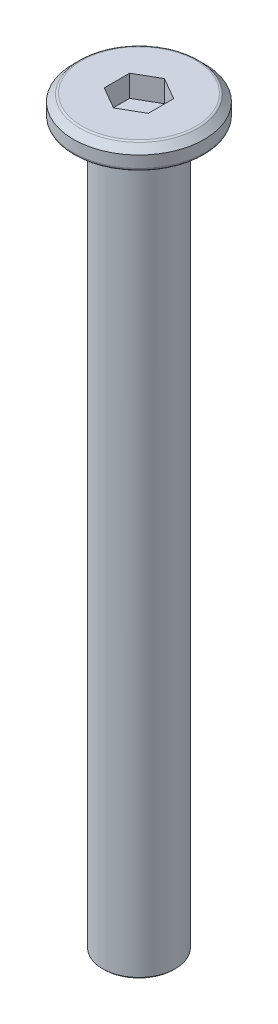
ISO-10303-21;
HEADER;
FILE_DESCRIPTION(('STEP AP214'),'2;1');
FILE_NAME('part.step','',(''),(''),'','','');
FILE_SCHEMA(('AUTOMOTIVE_DESIGN { 1 0 10303 214 1 1 1 1 }'));
ENDSEC;
DATA;
#1=APPLICATION_CONTEXT('core data for automotive mechanical design processes');
#2=APPLICATION_PROTOCOL_DEFINITION('international standard','automotive_design',2000,#1);
#3=PRODUCT_CONTEXT('',#1,'mechanical');
#4=PRODUCT('Part','Part','',(#3));
#5=PRODUCT_RELATED_PRODUCT_CATEGORY('part','',(#4));
#6=PRODUCT_DEFINITION_FORMATION('','',#4);
#7=PRODUCT_DEFINITION_CONTEXT('part definition',#1,'design');
#8=PRODUCT_DEFINITION('design','',#6,#7);
#9=PRODUCT_DEFINITION_SHAPE('','',#8);
#10=(LENGTH_UNIT() NAMED_UNIT(*) SI_UNIT(.MILLI.,.METRE.));
#11=(NAMED_UNIT(*) PLANE_ANGLE_UNIT() SI_UNIT($,.RADIAN.));
#12=(NAMED_UNIT(*) SI_UNIT($,.STERADIAN.) SOLID_ANGLE_UNIT());
#13=UNCERTAINTY_MEASURE_WITH_UNIT(LENGTH_MEASURE(1.E-05),#10,'distance_accuracy_value','');
#14=(GEOMETRIC_REPRESENTATION_CONTEXT(3) GLOBAL_UNCERTAINTY_ASSIGNED_CONTEXT((#13)) GLOBAL_UNIT_ASSIGNED_CONTEXT((#10,
#11,#12)) REPRESENTATION_CONTEXT('',''));
#15=CARTESIAN_POINT('',(0.,0.,0.));
#16=DIRECTION('',(0.,0.,1.));
#17=DIRECTION('',(1.,0.,0.));
#18=AXIS2_PLACEMENT_3D('',#15,#16,#17);
#19=CARTESIAN_POINT('',(0.,1.5,0.));
#20=DIRECTION('',(0.,-1.,0.));
#21=DIRECTION('',(0.,0.,-1.));
#22=AXIS2_PLACEMENT_3D('',#19,#20,#21);
#23=CYLINDRICAL_SURFACE('',#22,4.5);
#24=CARTESIAN_POINT('',(0.,0.2,0.));
#25=DIRECTION('',(0.,1.,0.));
#26=DIRECTION('',(0.,0.,1.));
#27=AXIS2_PLACEMENT_3D('',#24,#25,#26);
#28=CIRCLE('',#27,4.5);
#29=CARTESIAN_POINT('',(0.,0.2,4.5));
#30=VERTEX_POINT('',#29);
#31=EDGE_CURVE('E131',#30,#30,#28,.T.);
#32=ORIENTED_EDGE('',*,*,#31,.T.);
#33=EDGE_LOOP('',(#32));
#34=FACE_BOUND('',#33,.T.);
#35=CARTESIAN_POINT('',(0.,0.999999999999997,0.));
#36=DIRECTION('',(0.,1.,0.));
#37=DIRECTION('',(0.,0.,1.));
#38=AXIS2_PLACEMENT_3D('',#35,#36,#37);
#39=CIRCLE('',#38,4.5);
#40=CARTESIAN_POINT('',(0.,0.999999999999997,4.5));
#41=VERTEX_POINT('',#40);
#42=EDGE_CURVE('E117',#41,#41,#39,.F.);
#43=ORIENTED_EDGE('',*,*,#42,.T.);
#44=EDGE_LOOP('',(#43));
#45=FACE_BOUND('',#44,.T.);
#46=ADVANCED_FACE('F16',(#34,#45),#23,.T.);
#47=CARTESIAN_POINT('',(0.,1.5,0.));
#48=DIRECTION('',(0.,1.,0.));
#49=DIRECTION('',(0.,0.,1.));
#50=AXIS2_PLACEMENT_3D('',#47,#48,#49);
#51=PLANE('',#50);
#52=CARTESIAN_POINT('',(0.,1.5,0.));
#53=DIRECTION('',(0.,1.,0.));
#54=DIRECTION('',(0.,0.,1.));
#55=AXIS2_PLACEMENT_3D('',#52,#53,#54);
#56=CIRCLE('',#55,3.91715728752538);
#57=CARTESIAN_POINT('',(0.,1.5,3.91715728752538));
#58=VERTEX_POINT('',#57);
#59=EDGE_CURVE('E125',#58,#58,#56,.T.);
#60=ORIENTED_EDGE('',*,*,#59,.T.);
#61=EDGE_LOOP('',(#60));
#62=FACE_BOUND('',#61,.T.);
#63=DIRECTION('',(-0.866025403784439,0.,-0.5));
#64=VECTOR('',#63,1.);
#65=CARTESIAN_POINT('',(1.51554445662277,1.5,-0.875));
#66=LINE('',#65,#64);
#67=CARTESIAN_POINT('',(1.51554445662277,1.5,-0.875));
#68=VERTEX_POINT('',#67);
#69=CARTESIAN_POINT('',(0.,1.5,-1.75));
#70=VERTEX_POINT('',#69);
#71=EDGE_CURVE('E32',#68,#70,#66,.T.);
#72=ORIENTED_EDGE('',*,*,#71,.F.);
#73=DIRECTION('',(0.,0.,-1.));
#74=VECTOR('',#73,1.);
#75=CARTESIAN_POINT('',(1.51554445662277,1.5,0.875000000000001));
#76=LINE('',#75,#74);
#77=CARTESIAN_POINT('',(1.51554445662277,1.5,0.875000000000001));
#78=VERTEX_POINT('',#77);
#79=EDGE_CURVE('E113',#78,#68,#76,.T.);
#80=ORIENTED_EDGE('',*,*,#79,.F.);
#81=DIRECTION('',(0.866025403784439,0.,-0.5));
#82=VECTOR('',#81,1.);
#83=CARTESIAN_POINT('',(0.,1.5,1.75));
#84=LINE('',#83,#82);
#85=CARTESIAN_POINT('',(0.,1.5,1.75));
#86=VERTEX_POINT('',#85);
#87=EDGE_CURVE('E111',#86,#78,#84,.T.);
#88=ORIENTED_EDGE('',*,*,#87,.F.);
#89=DIRECTION('',(0.866025403784439,0.,0.5));
#90=VECTOR('',#89,1.);
#91=CARTESIAN_POINT('',(-1.51554445662277,1.5,0.875000000000001));
#92=LINE('',#91,#90);
#93=CARTESIAN_POINT('',(-1.51554445662277,1.5,0.875000000000001));
#94=VERTEX_POINT('',#93);
#95=EDGE_CURVE('E79',#94,#86,#92,.T.);
#96=ORIENTED_EDGE('',*,*,#95,.F.);
#97=DIRECTION('',(0.,0.,1.));
#98=VECTOR('',#97,1.);
#99=CARTESIAN_POINT('',(-1.51554445662277,1.5,-0.875));
#100=LINE('',#99,#98);
#101=CARTESIAN_POINT('',(-1.51554445662277,1.5,-0.875));
#102=VERTEX_POINT('',#101);
#103=EDGE_CURVE('E107',#102,#94,#100,.T.);
#104=ORIENTED_EDGE('',*,*,#103,.F.);
#105=DIRECTION('',(-0.866025403784439,0.,0.5));
#106=VECTOR('',#105,1.);
#107=CARTESIAN_POINT('',(0.,1.5,-1.75));
#108=LINE('',#107,#106);
#109=EDGE_CURVE('E104',#70,#102,#108,.T.);
#110=ORIENTED_EDGE('',*,*,#109,.F.);
#111=EDGE_LOOP('',(#72,#80,#88,#96,#104,#110));
#112=FACE_BOUND('',#111,.T.);
#113=ADVANCED_FACE('F158',(#62,#112),#51,.T.);
#114=CARTESIAN_POINT('',(0.,0.,0.));
#115=DIRECTION('',(0.,1.,0.));
#116=DIRECTION('',(0.,0.,1.));
#117=AXIS2_PLACEMENT_3D('',#114,#115,#116);
#118=PLANE('',#117);
#119=CARTESIAN_POINT('',(0.,0.,0.));
#120=DIRECTION('',(0.,1.,0.));
#121=DIRECTION('',(0.,0.,1.));
#122=AXIS2_PLACEMENT_3D('',#119,#120,#121);
#123=CIRCLE('',#122,2.75);
#124=CARTESIAN_POINT('',(0.,0.,2.75));
#125=VERTEX_POINT('',#124);
#126=EDGE_CURVE('E140',#125,#125,#123,.T.);
#127=ORIENTED_EDGE('',*,*,#126,.T.);
#128=EDGE_LOOP('',(#127));
#129=FACE_BOUND('',#128,.T.);
#130=CARTESIAN_POINT('',(0.,0.,0.));
#131=DIRECTION('',(0.,1.,0.));
#132=DIRECTION('',(0.,0.,1.));
#133=AXIS2_PLACEMENT_3D('',#130,#131,#132);
#134=CIRCLE('',#133,4.3);
#135=CARTESIAN_POINT('',(0.,0.,4.3));
#136=VERTEX_POINT('',#135);
#137=EDGE_CURVE('E134',#136,#136,#134,.F.);
#138=ORIENTED_EDGE('',*,*,#137,.T.);
#139=EDGE_LOOP('',(#138));
#140=FACE_BOUND('',#139,.T.);
#141=ADVANCED_FACE('F164',(#129,#140),#118,.F.);
#142=CARTESIAN_POINT('',(0.,1.5,0.));
#143=DIRECTION('',(0.,-1.,0.));
#144=DIRECTION('',(0.,0.,-1.));
#145=AXIS2_PLACEMENT_3D('',#142,#143,#144);
#146=CONICAL_SURFACE('',#145,4.,0.785398163397447);
#147=CARTESIAN_POINT('',(0.,1.44142135623731,0.));
#148=DIRECTION('',(0.,1.,0.));
#149=DIRECTION('',(0.,0.,1.));
#150=AXIS2_PLACEMENT_3D('',#147,#148,#149);
#151=CIRCLE('',#150,4.05857864376269);
#152=CARTESIAN_POINT('',(0.,1.44142135623731,4.05857864376269));
#153=VERTEX_POINT('',#152);
#154=EDGE_CURVE('E128',#153,#153,#151,.F.);
#155=ORIENTED_EDGE('',*,*,#154,.T.);
#156=EDGE_LOOP('',(#155));
#157=FACE_BOUND('',#156,.T.);
#158=ORIENTED_EDGE('',*,*,#42,.F.);
#159=EDGE_LOOP('',(#158));
#160=FACE_BOUND('',#159,.T.);
#161=ADVANCED_FACE('F170',(#157,#160),#146,.T.);
#162=CARTESIAN_POINT('',(1.51554445662277,0.,-0.875));
#163=DIRECTION('',(0.5,0.,-0.866025403784439));
#164=DIRECTION('',(-0.866025403784439,0.,-0.5));
#165=AXIS2_PLACEMENT_3D('',#162,#163,#164);
#166=PLANE('',#165);
#167=ORIENTED_EDGE('',*,*,#71,.T.);
#168=DIRECTION('',(0.,1.,0.));
#169=VECTOR('',#168,1.);
#170=CARTESIAN_POINT('',(0.,0.,-1.75));
#171=LINE('',#170,#169);
#172=CARTESIAN_POINT('',(0.,0.,-1.75));
#173=VERTEX_POINT('',#172);
#174=EDGE_CURVE('E63',#173,#70,#171,.T.);
#175=ORIENTED_EDGE('',*,*,#174,.F.);
#176=DIRECTION('',(-0.866025403784439,0.,-0.5));
#177=VECTOR('',#176,1.);
#178=CARTESIAN_POINT('',(1.51554445662277,0.,-0.875));
#179=LINE('',#178,#177);
#180=CARTESIAN_POINT('',(1.51554445662277,0.,-0.875));
#181=VERTEX_POINT('',#180);
#182=EDGE_CURVE('E115',#181,#173,#179,.T.);
#183=ORIENTED_EDGE('',*,*,#182,.F.);
#184=DIRECTION('',(0.,1.,0.));
#185=VECTOR('',#184,1.);
#186=CARTESIAN_POINT('',(1.51554445662277,0.,-0.875));
#187=LINE('',#186,#185);
#188=EDGE_CURVE('E40',#181,#68,#187,.T.);
#189=ORIENTED_EDGE('',*,*,#188,.T.);
#190=EDGE_LOOP('',(#167,#175,#183,#189));
#191=FACE_BOUND('',#190,.T.);
#192=ADVANCED_FACE('F173',(#191),#166,.F.);
#193=CARTESIAN_POINT('',(1.51554445662277,0.,0.875000000000001));
#194=DIRECTION('',(1.,0.,0.));
#195=DIRECTION('',(0.,0.,-1.));
#196=AXIS2_PLACEMENT_3D('',#193,#194,#195);
#197=PLANE('',#196);
#198=ORIENTED_EDGE('',*,*,#79,.T.);
#199=ORIENTED_EDGE('',*,*,#188,.F.);
#200=DIRECTION('',(0.,0.,-1.));
#201=VECTOR('',#200,1.);
#202=CARTESIAN_POINT('',(1.51554445662277,0.,0.875000000000001));
#203=LINE('',#202,#201);
#204=CARTESIAN_POINT('',(1.51554445662277,0.,0.875000000000001));
#205=VERTEX_POINT('',#204);
#206=EDGE_CURVE('E91',#205,#181,#203,.T.);
#207=ORIENTED_EDGE('',*,*,#206,.F.);
#208=DIRECTION('',(0.,1.,0.));
#209=VECTOR('',#208,1.);
#210=CARTESIAN_POINT('',(1.51554445662277,0.,0.875000000000001));
#211=LINE('',#210,#209);
#212=EDGE_CURVE('E83',#205,#78,#211,.T.);
#213=ORIENTED_EDGE('',*,*,#212,.T.);
#214=EDGE_LOOP('',(#198,#199,#207,#213));
#215=FACE_BOUND('',#214,.T.);
#216=ADVANCED_FACE('F207',(#215),#197,.F.);
#217=CARTESIAN_POINT('',(0.,0.,1.75));
#218=DIRECTION('',(0.5,0.,0.866025403784439));
#219=DIRECTION('',(0.866025403784439,0.,-0.5));
#220=AXIS2_PLACEMENT_3D('',#217,#218,#219);
#221=PLANE('',#220);
#222=ORIENTED_EDGE('',*,*,#87,.T.);
#223=ORIENTED_EDGE('',*,*,#212,.F.);
#224=DIRECTION('',(0.866025403784439,0.,-0.5));
#225=VECTOR('',#224,1.);
#226=CARTESIAN_POINT('',(0.,0.,1.75));
#227=LINE('',#226,#225);
#228=CARTESIAN_POINT('',(0.,0.,1.75));
#229=VERTEX_POINT('',#228);
#230=EDGE_CURVE('E87',#229,#205,#227,.T.);
#231=ORIENTED_EDGE('',*,*,#230,.F.);
#232=DIRECTION('',(0.,1.,0.));
#233=VECTOR('',#232,1.);
#234=CARTESIAN_POINT('',(0.,0.,1.75));
#235=LINE('',#234,#233);
#236=EDGE_CURVE('E72',#229,#86,#235,.T.);
#237=ORIENTED_EDGE('',*,*,#236,.T.);
#238=EDGE_LOOP('',(#222,#223,#231,#237));
#239=FACE_BOUND('',#238,.T.);
#240=ADVANCED_FACE('F88',(#239),#221,.F.);
#241=CARTESIAN_POINT('',(-1.51554445662277,0.,0.875000000000001));
#242=DIRECTION('',(-0.5,0.,0.866025403784439));
#243=DIRECTION('',(0.866025403784439,0.,0.5));
#244=AXIS2_PLACEMENT_3D('',#241,#242,#243);
#245=PLANE('',#244);
#246=ORIENTED_EDGE('',*,*,#95,.T.);
#247=ORIENTED_EDGE('',*,*,#236,.F.);
#248=DIRECTION('',(0.866025403784439,0.,0.5));
#249=VECTOR('',#248,1.);
#250=CARTESIAN_POINT('',(-1.51554445662277,0.,0.875000000000001));
#251=LINE('',#250,#249);
#252=CARTESIAN_POINT('',(-1.51554445662277,0.,0.875000000000001));
#253=VERTEX_POINT('',#252);
#254=EDGE_CURVE('E76',#253,#229,#251,.T.);
#255=ORIENTED_EDGE('',*,*,#254,.F.);
#256=DIRECTION('',(0.,1.,0.));
#257=VECTOR('',#256,1.);
#258=CARTESIAN_POINT('',(-1.51554445662277,0.,0.875000000000001));
#259=LINE('',#258,#257);
#260=EDGE_CURVE('E84',#253,#94,#259,.T.);
#261=ORIENTED_EDGE('',*,*,#260,.T.);
#262=EDGE_LOOP('',(#246,#247,#255,#261));
#263=FACE_BOUND('',#262,.T.);
#264=ADVANCED_FACE('F74',(#263),#245,.F.);
#265=CARTESIAN_POINT('',(-1.51554445662277,0.,-0.875));
#266=DIRECTION('',(-1.,0.,0.));
#267=DIRECTION('',(0.,0.,1.));
#268=AXIS2_PLACEMENT_3D('',#265,#266,#267);
#269=PLANE('',#268);
#270=ORIENTED_EDGE('',*,*,#103,.T.);
#271=ORIENTED_EDGE('',*,*,#260,.F.);
#272=DIRECTION('',(0.,0.,1.));
#273=VECTOR('',#272,1.);
#274=CARTESIAN_POINT('',(-1.51554445662277,0.,-0.875));
#275=LINE('',#274,#273);
#276=CARTESIAN_POINT('',(-1.51554445662277,0.,-0.875));
#277=VERTEX_POINT('',#276);
#278=EDGE_CURVE('E96',#277,#253,#275,.T.);
#279=ORIENTED_EDGE('',*,*,#278,.F.);
#280=DIRECTION('',(0.,1.,0.));
#281=VECTOR('',#280,1.);
#282=CARTESIAN_POINT('',(-1.51554445662277,0.,-0.875));
#283=LINE('',#282,#281);
#284=EDGE_CURVE('E120',#277,#102,#283,.T.);
#285=ORIENTED_EDGE('',*,*,#284,.T.);
#286=EDGE_LOOP('',(#270,#271,#279,#285));
#287=FACE_BOUND('',#286,.T.);
#288=ADVANCED_FACE('F214',(#287),#269,.F.);
#289=CARTESIAN_POINT('',(0.,0.,-1.75));
#290=DIRECTION('',(-0.5,0.,-0.866025403784439));
#291=DIRECTION('',(-0.866025403784439,0.,0.5));
#292=AXIS2_PLACEMENT_3D('',#289,#290,#291);
#293=PLANE('',#292);
#294=ORIENTED_EDGE('',*,*,#109,.T.);
#295=ORIENTED_EDGE('',*,*,#284,.F.);
#296=DIRECTION('',(-0.866025403784439,0.,0.5));
#297=VECTOR('',#296,1.);
#298=CARTESIAN_POINT('',(0.,0.,-1.75));
#299=LINE('',#298,#297);
#300=EDGE_CURVE('E98',#173,#277,#299,.T.);
#301=ORIENTED_EDGE('',*,*,#300,.F.);
#302=ORIENTED_EDGE('',*,*,#174,.T.);
#303=EDGE_LOOP('',(#294,#295,#301,#302));
#304=FACE_BOUND('',#303,.T.);
#305=ADVANCED_FACE('F204',(#304),#293,.F.);
#306=CARTESIAN_POINT('',(0.,0.,0.));
#307=DIRECTION('',(0.,-1.,0.));
#308=DIRECTION('',(0.,0.,-1.));
#309=AXIS2_PLACEMENT_3D('',#306,#307,#308);
#310=PLANE('',#309);
#311=ORIENTED_EDGE('',*,*,#206,.T.);
#312=ORIENTED_EDGE('',*,*,#182,.T.);
#313=ORIENTED_EDGE('',*,*,#300,.T.);
#314=ORIENTED_EDGE('',*,*,#278,.T.);
#315=ORIENTED_EDGE('',*,*,#254,.T.);
#316=ORIENTED_EDGE('',*,*,#230,.T.);
#317=EDGE_LOOP('',(#311,#312,#313,#314,#315,#316));
#318=FACE_BOUND('',#317,.T.);
#319=ADVANCED_FACE('F93',(#318),#310,.F.);
#320=CARTESIAN_POINT('',(0.,-49.5,0.));
#321=DIRECTION('',(0.,1.,0.));
#322=DIRECTION('',(0.,0.,1.));
#323=AXIS2_PLACEMENT_3D('',#320,#321,#322);
#324=CYLINDRICAL_SURFACE('',#323,2.5);
#325=CARTESIAN_POINT('',(0.,-49.4,0.));
#326=DIRECTION('',(0.,-1.,0.));
#327=DIRECTION('',(0.,0.,-1.));
#328=AXIS2_PLACEMENT_3D('',#325,#326,#327);
#329=CIRCLE('',#328,2.5);
#330=CARTESIAN_POINT('',(0.,-49.4,-2.5));
#331=VERTEX_POINT('',#330);
#332=EDGE_CURVE('E10',#331,#331,#329,.F.);
#333=ORIENTED_EDGE('',*,*,#332,.T.);
#334=EDGE_LOOP('',(#333));
#335=FACE_BOUND('',#334,.T.);
#336=CARTESIAN_POINT('',(0.,-0.25,0.));
#337=DIRECTION('',(0.,1.,0.));
#338=DIRECTION('',(0.,0.,1.));
#339=AXIS2_PLACEMENT_3D('',#336,#337,#338);
#340=CIRCLE('',#339,2.5);
#341=CARTESIAN_POINT('',(0.,-0.25,2.5));
#342=VERTEX_POINT('',#341);
#343=EDGE_CURVE('E137',#342,#342,#340,.F.);
#344=ORIENTED_EDGE('',*,*,#343,.T.);
#345=EDGE_LOOP('',(#344));
#346=FACE_BOUND('',#345,.T.);
#347=ADVANCED_FACE('F195',(#335,#346),#324,.T.);
#348=CARTESIAN_POINT('',(0.,-49.5,0.));
#349=DIRECTION('',(0.,-1.,0.));
#350=DIRECTION('',(0.,0.,-1.));
#351=AXIS2_PLACEMENT_3D('',#348,#349,#350);
#352=PLANE('',#351);
#353=CARTESIAN_POINT('',(0.,-49.5,0.));
#354=DIRECTION('',(0.,-1.,0.));
#355=DIRECTION('',(0.,0.,-1.));
#356=AXIS2_PLACEMENT_3D('',#353,#354,#355);
#357=CIRCLE('',#356,2.4);
#358=CARTESIAN_POINT('',(0.,-49.5,-2.4));
#359=VERTEX_POINT('',#358);
#360=EDGE_CURVE('E25',#359,#359,#357,.T.);
#361=ORIENTED_EDGE('',*,*,#360,.T.);
#362=EDGE_LOOP('',(#361));
#363=FACE_BOUND('',#362,.T.);
#364=ADVANCED_FACE('F145',(#363),#352,.T.);
#365=CARTESIAN_POINT('',(0.,1.3,0.));
#366=DIRECTION('',(0.,1.,0.));
#367=DIRECTION('',(0.,0.,1.));
#368=AXIS2_PLACEMENT_3D('',#365,#366,#367);
#369=TOROIDAL_SURFACE('',#368,3.91715728752538,0.2);
#370=ORIENTED_EDGE('',*,*,#154,.F.);
#371=EDGE_LOOP('',(#370));
#372=FACE_BOUND('',#371,.T.);
#373=ORIENTED_EDGE('',*,*,#59,.F.);
#374=EDGE_LOOP('',(#373));
#375=FACE_BOUND('',#374,.T.);
#376=ADVANCED_FACE('F175',(#372,#375),#369,.T.);
#377=CARTESIAN_POINT('',(0.,0.2,0.));
#378=DIRECTION('',(0.,1.,0.));
#379=DIRECTION('',(0.,0.,1.));
#380=AXIS2_PLACEMENT_3D('',#377,#378,#379);
#381=TOROIDAL_SURFACE('',#380,4.3,0.2);
#382=ORIENTED_EDGE('',*,*,#137,.F.);
#383=EDGE_LOOP('',(#382));
#384=FACE_BOUND('',#383,.T.);
#385=ORIENTED_EDGE('',*,*,#31,.F.);
#386=EDGE_LOOP('',(#385));
#387=FACE_BOUND('',#386,.T.);
#388=ADVANCED_FACE('F154',(#384,#387),#381,.T.);
#389=CARTESIAN_POINT('',(0.,-0.25,0.));
#390=DIRECTION('',(0.,1.,0.));
#391=DIRECTION('',(0.,0.,1.));
#392=AXIS2_PLACEMENT_3D('',#389,#390,#391);
#393=TOROIDAL_SURFACE('',#392,2.75,0.25);
#394=ORIENTED_EDGE('',*,*,#126,.F.);
#395=EDGE_LOOP('',(#394));
#396=FACE_BOUND('',#395,.T.);
#397=ORIENTED_EDGE('',*,*,#343,.F.);
#398=EDGE_LOOP('',(#397));
#399=FACE_BOUND('',#398,.T.);
#400=ADVANCED_FACE('F148',(#396,#399),#393,.F.);
#401=CARTESIAN_POINT('',(0.,-49.5,0.));
#402=DIRECTION('',(0.,1.,0.));
#403=DIRECTION('',(0.,0.,1.));
#404=AXIS2_PLACEMENT_3D('',#401,#402,#403);
#405=CONICAL_SURFACE('',#404,2.4,0.785398163397403);
#406=ORIENTED_EDGE('',*,*,#332,.F.);
#407=EDGE_LOOP('',(#406));
#408=FACE_BOUND('',#407,.T.);
#409=ORIENTED_EDGE('',*,*,#360,.F.);
#410=EDGE_LOOP('',(#409));
#411=FACE_BOUND('',#410,.T.);
#412=ADVANCED_FACE('F19',(#408,#411),#405,.T.);
#413=CLOSED_SHELL('',(#46,#113,#141,#161,#192,#216,#240,#264,#288,#305,#319,#347,#364,#376,#388,
#400,#412));
#414=MANIFOLD_SOLID_BREP('B1',#413);
#415=ADVANCED_BREP_SHAPE_REPRESENTATION('',(#18,#414),#14);
#416=SHAPE_DEFINITION_REPRESENTATION(#9,#415);
ENDSEC;
END-ISO-10303-21;
